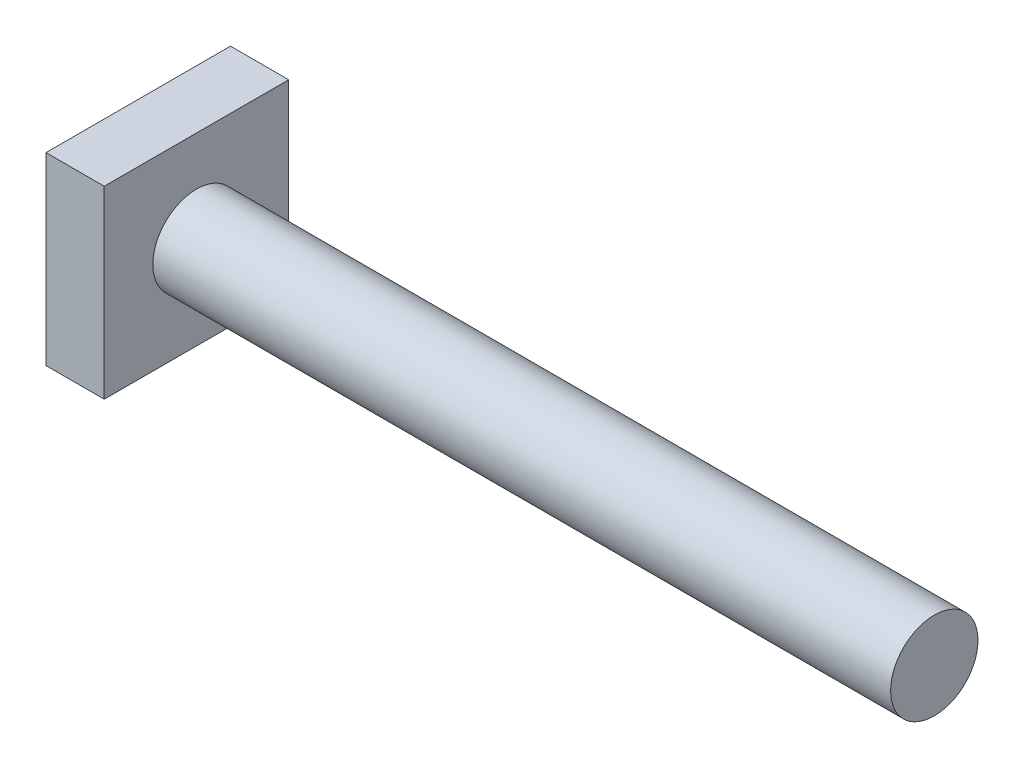
ISO-10303-21;
HEADER;
FILE_DESCRIPTION(('STEP AP214'),'2;1');
FILE_NAME('part.step','',(''),(''),'','','');
FILE_SCHEMA(('AUTOMOTIVE_DESIGN { 1 0 10303 214 1 1 1 1 }'));
ENDSEC;
DATA;
#1=APPLICATION_CONTEXT('core data for automotive mechanical design processes');
#2=APPLICATION_PROTOCOL_DEFINITION('international standard','automotive_design',2000,#1);
#3=PRODUCT_CONTEXT('',#1,'mechanical');
#4=PRODUCT('Part','Part','',(#3));
#5=PRODUCT_RELATED_PRODUCT_CATEGORY('part','',(#4));
#6=PRODUCT_DEFINITION_FORMATION('','',#4);
#7=PRODUCT_DEFINITION_CONTEXT('part definition',#1,'design');
#8=PRODUCT_DEFINITION('design','',#6,#7);
#9=PRODUCT_DEFINITION_SHAPE('','',#8);
#10=(LENGTH_UNIT() NAMED_UNIT(*) SI_UNIT(.MILLI.,.METRE.));
#11=(NAMED_UNIT(*) PLANE_ANGLE_UNIT() SI_UNIT($,.RADIAN.));
#12=(NAMED_UNIT(*) SI_UNIT($,.STERADIAN.) SOLID_ANGLE_UNIT());
#13=UNCERTAINTY_MEASURE_WITH_UNIT(LENGTH_MEASURE(1.E-05),#10,'distance_accuracy_value','');
#14=(GEOMETRIC_REPRESENTATION_CONTEXT(3) GLOBAL_UNCERTAINTY_ASSIGNED_CONTEXT((#13)) GLOBAL_UNIT_ASSIGNED_CONTEXT((#10,
#11,#12)) REPRESENTATION_CONTEXT('',''));
#15=CARTESIAN_POINT('',(0.,0.,0.));
#16=DIRECTION('',(0.,0.,1.));
#17=DIRECTION('',(1.,0.,0.));
#18=AXIS2_PLACEMENT_3D('',#15,#16,#17);
#19=CARTESIAN_POINT('',(6.,-9.5,-9.5));
#20=DIRECTION('',(0.,0.,1.));
#21=DIRECTION('',(1.,0.,0.));
#22=AXIS2_PLACEMENT_3D('',#19,#20,#21);
#23=PLANE('',#22);
#24=DIRECTION('',(0.,1.,0.));
#25=VECTOR('',#24,1.);
#26=CARTESIAN_POINT('',(0.,-9.5,-9.5));
#27=LINE('',#26,#25);
#28=CARTESIAN_POINT('',(0.,-9.5,-9.5));
#29=VERTEX_POINT('',#28);
#30=CARTESIAN_POINT('',(0.,9.5,-9.5));
#31=VERTEX_POINT('',#30);
#32=EDGE_CURVE('E98',#29,#31,#27,.T.);
#33=ORIENTED_EDGE('',*,*,#32,.T.);
#34=DIRECTION('',(-1.,0.,0.));
#35=VECTOR('',#34,1.);
#36=CARTESIAN_POINT('',(6.,9.5,-9.5));
#37=LINE('',#36,#35);
#38=CARTESIAN_POINT('',(6.,9.5,-9.5));
#39=VERTEX_POINT('',#38);
#40=EDGE_CURVE('E40',#39,#31,#37,.T.);
#41=ORIENTED_EDGE('',*,*,#40,.F.);
#42=DIRECTION('',(0.,1.,0.));
#43=VECTOR('',#42,1.);
#44=CARTESIAN_POINT('',(6.,-9.5,-9.5));
#45=LINE('',#44,#43);
#46=CARTESIAN_POINT('',(6.,-9.5,-9.5));
#47=VERTEX_POINT('',#46);
#48=EDGE_CURVE('E84',#47,#39,#45,.T.);
#49=ORIENTED_EDGE('',*,*,#48,.F.);
#50=DIRECTION('',(-1.,0.,0.));
#51=VECTOR('',#50,1.);
#52=CARTESIAN_POINT('',(6.,-9.5,-9.5));
#53=LINE('',#52,#51);
#54=EDGE_CURVE('E94',#47,#29,#53,.T.);
#55=ORIENTED_EDGE('',*,*,#54,.T.);
#56=EDGE_LOOP('',(#33,#41,#49,#55));
#57=FACE_BOUND('',#56,.T.);
#58=ADVANCED_FACE('F32',(#57),#23,.F.);
#59=CARTESIAN_POINT('',(6.,9.5,9.5));
#60=DIRECTION('',(0.,-1.,0.));
#61=DIRECTION('',(0.,0.,-1.));
#62=AXIS2_PLACEMENT_3D('',#59,#60,#61);
#63=PLANE('',#62);
#64=DIRECTION('',(0.,0.,1.));
#65=VECTOR('',#64,1.);
#66=CARTESIAN_POINT('',(0.,9.5,9.5));
#67=LINE('',#66,#65);
#68=CARTESIAN_POINT('',(0.,9.5,9.5));
#69=VERTEX_POINT('',#68);
#70=EDGE_CURVE('E89',#31,#69,#67,.T.);
#71=ORIENTED_EDGE('',*,*,#70,.T.);
#72=DIRECTION('',(-1.,0.,0.));
#73=VECTOR('',#72,1.);
#74=CARTESIAN_POINT('',(6.,9.5,9.5));
#75=LINE('',#74,#73);
#76=CARTESIAN_POINT('',(6.,9.5,9.5));
#77=VERTEX_POINT('',#76);
#78=EDGE_CURVE('E87',#77,#69,#75,.T.);
#79=ORIENTED_EDGE('',*,*,#78,.F.);
#80=DIRECTION('',(0.,0.,1.));
#81=VECTOR('',#80,1.);
#82=CARTESIAN_POINT('',(6.,9.5,9.5));
#83=LINE('',#82,#81);
#84=EDGE_CURVE('E79',#39,#77,#83,.T.);
#85=ORIENTED_EDGE('',*,*,#84,.F.);
#86=ORIENTED_EDGE('',*,*,#40,.T.);
#87=EDGE_LOOP('',(#71,#79,#85,#86));
#88=FACE_BOUND('',#87,.T.);
#89=ADVANCED_FACE('F88',(#88),#63,.F.);
#90=CARTESIAN_POINT('',(6.,-9.5,9.5));
#91=DIRECTION('',(0.,0.,-1.));
#92=DIRECTION('',(-1.,0.,0.));
#93=AXIS2_PLACEMENT_3D('',#90,#91,#92);
#94=PLANE('',#93);
#95=DIRECTION('',(0.,-1.,0.));
#96=VECTOR('',#95,1.);
#97=CARTESIAN_POINT('',(0.,-9.5,9.5));
#98=LINE('',#97,#96);
#99=CARTESIAN_POINT('',(0.,-9.5,9.5));
#100=VERTEX_POINT('',#99);
#101=EDGE_CURVE('E65',#69,#100,#98,.T.);
#102=ORIENTED_EDGE('',*,*,#101,.T.);
#103=DIRECTION('',(-1.,0.,0.));
#104=VECTOR('',#103,1.);
#105=CARTESIAN_POINT('',(6.,-9.5,9.5));
#106=LINE('',#105,#104);
#107=CARTESIAN_POINT('',(6.,-9.5,9.5));
#108=VERTEX_POINT('',#107);
#109=EDGE_CURVE('E90',#108,#100,#106,.T.);
#110=ORIENTED_EDGE('',*,*,#109,.F.);
#111=DIRECTION('',(0.,-1.,0.));
#112=VECTOR('',#111,1.);
#113=CARTESIAN_POINT('',(6.,-9.5,9.5));
#114=LINE('',#113,#112);
#115=EDGE_CURVE('E82',#77,#108,#114,.T.);
#116=ORIENTED_EDGE('',*,*,#115,.F.);
#117=ORIENTED_EDGE('',*,*,#78,.T.);
#118=EDGE_LOOP('',(#102,#110,#116,#117));
#119=FACE_BOUND('',#118,.T.);
#120=ADVANCED_FACE('F92',(#119),#94,.F.);
#121=CARTESIAN_POINT('',(6.,-9.5,9.5));
#122=DIRECTION('',(0.,1.,0.));
#123=DIRECTION('',(0.,0.,1.));
#124=AXIS2_PLACEMENT_3D('',#121,#122,#123);
#125=PLANE('',#124);
#126=DIRECTION('',(0.,0.,-1.));
#127=VECTOR('',#126,1.);
#128=CARTESIAN_POINT('',(0.,-9.5,9.5));
#129=LINE('',#128,#127);
#130=EDGE_CURVE('E71',#100,#29,#129,.T.);
#131=ORIENTED_EDGE('',*,*,#130,.T.);
#132=ORIENTED_EDGE('',*,*,#54,.F.);
#133=DIRECTION('',(0.,0.,-1.));
#134=VECTOR('',#133,1.);
#135=CARTESIAN_POINT('',(6.,-9.5,9.5));
#136=LINE('',#135,#134);
#137=EDGE_CURVE('E48',#108,#47,#136,.T.);
#138=ORIENTED_EDGE('',*,*,#137,.F.);
#139=ORIENTED_EDGE('',*,*,#109,.T.);
#140=EDGE_LOOP('',(#131,#132,#138,#139));
#141=FACE_BOUND('',#140,.T.);
#142=ADVANCED_FACE('F120',(#141),#125,.F.);
#143=CARTESIAN_POINT('',(6.,0.,0.));
#144=DIRECTION('',(-1.,0.,0.));
#145=DIRECTION('',(0.,0.,1.));
#146=AXIS2_PLACEMENT_3D('',#143,#144,#145);
#147=PLANE('',#146);
#148=CARTESIAN_POINT('',(6.00000000000001,0.,0.));
#149=DIRECTION('',(-1.,0.,0.));
#150=DIRECTION('',(0.,0.,1.));
#151=AXIS2_PLACEMENT_3D('',#148,#149,#150);
#152=CIRCLE('',#151,4.5);
#153=CARTESIAN_POINT('',(6.00000000000001,0.,4.5));
#154=VERTEX_POINT('',#153);
#155=EDGE_CURVE('E11',#154,#154,#152,.F.);
#156=ORIENTED_EDGE('',*,*,#155,.F.);
#157=EDGE_LOOP('',(#156));
#158=FACE_BOUND('',#157,.T.);
#159=ORIENTED_EDGE('',*,*,#48,.T.);
#160=ORIENTED_EDGE('',*,*,#84,.T.);
#161=ORIENTED_EDGE('',*,*,#115,.T.);
#162=ORIENTED_EDGE('',*,*,#137,.T.);
#163=EDGE_LOOP('',(#159,#160,#161,#162));
#164=FACE_BOUND('',#163,.T.);
#165=ADVANCED_FACE('F80',(#158,#164),#147,.F.);
#166=CARTESIAN_POINT('',(0.,0.,0.));
#167=DIRECTION('',(-1.,0.,0.));
#168=DIRECTION('',(0.,0.,1.));
#169=AXIS2_PLACEMENT_3D('',#166,#167,#168);
#170=PLANE('',#169);
#171=ORIENTED_EDGE('',*,*,#32,.F.);
#172=ORIENTED_EDGE('',*,*,#130,.F.);
#173=ORIENTED_EDGE('',*,*,#101,.F.);
#174=ORIENTED_EDGE('',*,*,#70,.F.);
#175=EDGE_LOOP('',(#171,#172,#173,#174));
#176=FACE_BOUND('',#175,.T.);
#177=ADVANCED_FACE('F109',(#176),#170,.T.);
#178=CARTESIAN_POINT('',(82.,0.,0.));
#179=DIRECTION('',(-1.,0.,0.));
#180=DIRECTION('',(0.,0.,1.));
#181=AXIS2_PLACEMENT_3D('',#178,#179,#180);
#182=CYLINDRICAL_SURFACE('',#181,4.5);
#183=CARTESIAN_POINT('',(82.,0.,0.));
#184=DIRECTION('',(1.,0.,0.));
#185=DIRECTION('',(0.,0.,-1.));
#186=AXIS2_PLACEMENT_3D('',#183,#184,#185);
#187=CIRCLE('',#186,4.5);
#188=CARTESIAN_POINT('',(82.,0.,-4.5));
#189=VERTEX_POINT('',#188);
#190=EDGE_CURVE('E101',#189,#189,#187,.T.);
#191=ORIENTED_EDGE('',*,*,#190,.F.);
#192=EDGE_LOOP('',(#191));
#193=FACE_BOUND('',#192,.T.);
#194=ORIENTED_EDGE('',*,*,#155,.T.);
#195=EDGE_LOOP('',(#194));
#196=FACE_BOUND('',#195,.T.);
#197=ADVANCED_FACE('F111',(#193,#196),#182,.T.);
#198=CARTESIAN_POINT('',(82.,0.,0.));
#199=DIRECTION('',(1.,0.,0.));
#200=DIRECTION('',(0.,0.,-1.));
#201=AXIS2_PLACEMENT_3D('',#198,#199,#200);
#202=PLANE('',#201);
#203=ORIENTED_EDGE('',*,*,#190,.T.);
#204=EDGE_LOOP('',(#203));
#205=FACE_BOUND('',#204,.T.);
#206=ADVANCED_FACE('F117',(#205),#202,.T.);
#207=CLOSED_SHELL('',(#58,#89,#120,#142,#165,#177,#197,#206));
#208=MANIFOLD_SOLID_BREP('B2',#207);
#209=ADVANCED_BREP_SHAPE_REPRESENTATION('',(#18,#208),#14);
#210=SHAPE_DEFINITION_REPRESENTATION(#9,#209);
ENDSEC;
END-ISO-10303-21;
